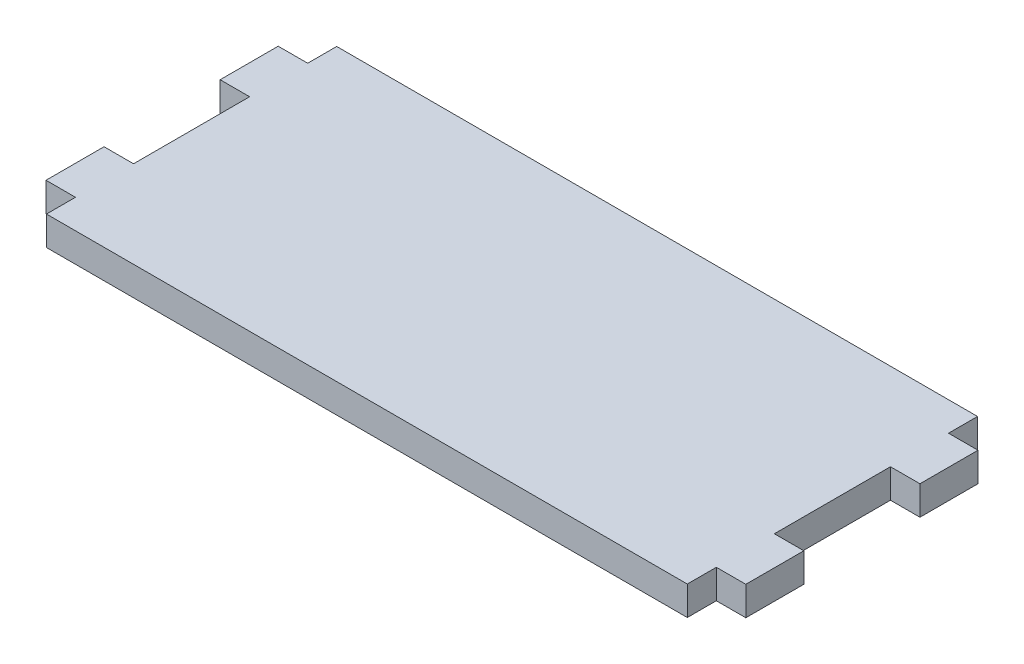
ISO-10303-21;
HEADER;
FILE_DESCRIPTION(('STEP AP214'),'2;1');
FILE_NAME('part.step','',(''),(''),'','','');
FILE_SCHEMA(('AUTOMOTIVE_DESIGN { 1 0 10303 214 1 1 1 1 }'));
ENDSEC;
DATA;
#1=APPLICATION_CONTEXT('core data for automotive mechanical design processes');
#2=APPLICATION_PROTOCOL_DEFINITION('international standard','automotive_design',2000,#1);
#3=PRODUCT_CONTEXT('',#1,'mechanical');
#4=PRODUCT('Part','Part','',(#3));
#5=PRODUCT_RELATED_PRODUCT_CATEGORY('part','',(#4));
#6=PRODUCT_DEFINITION_FORMATION('','',#4);
#7=PRODUCT_DEFINITION_CONTEXT('part definition',#1,'design');
#8=PRODUCT_DEFINITION('design','',#6,#7);
#9=PRODUCT_DEFINITION_SHAPE('','',#8);
#10=(LENGTH_UNIT() NAMED_UNIT(*) SI_UNIT(.MILLI.,.METRE.));
#11=(NAMED_UNIT(*) PLANE_ANGLE_UNIT() SI_UNIT($,.RADIAN.));
#12=(NAMED_UNIT(*) SI_UNIT($,.STERADIAN.) SOLID_ANGLE_UNIT());
#13=UNCERTAINTY_MEASURE_WITH_UNIT(LENGTH_MEASURE(1.E-05),#10,'distance_accuracy_value','');
#14=(GEOMETRIC_REPRESENTATION_CONTEXT(3) GLOBAL_UNCERTAINTY_ASSIGNED_CONTEXT((#13)) GLOBAL_UNIT_ASSIGNED_CONTEXT((#10,
#11,#12)) REPRESENTATION_CONTEXT('',''));
#15=CARTESIAN_POINT('',(0.,0.,0.));
#16=DIRECTION('',(0.,0.,1.));
#17=DIRECTION('',(1.,0.,0.));
#18=AXIS2_PLACEMENT_3D('',#15,#16,#17);
#19=CARTESIAN_POINT('',(35.052,3.175,15.875));
#20=DIRECTION('',(-1.,0.,0.));
#21=DIRECTION('',(0.,0.,1.));
#22=AXIS2_PLACEMENT_3D('',#19,#20,#21);
#23=PLANE('',#22);
#24=DIRECTION('',(0.,1.,0.));
#25=VECTOR('',#24,1.);
#26=CARTESIAN_POINT('',(35.052,0.,6.35));
#27=LINE('',#26,#25);
#28=CARTESIAN_POINT('',(35.052,0.,6.35));
#29=VERTEX_POINT('',#28);
#30=CARTESIAN_POINT('',(35.052,3.175,6.35));
#31=VERTEX_POINT('',#30);
#32=EDGE_CURVE('E204',#29,#31,#27,.T.);
#33=ORIENTED_EDGE('',*,*,#32,.F.);
#34=DIRECTION('',(0.,0.,-1.));
#35=VECTOR('',#34,1.);
#36=CARTESIAN_POINT('',(35.052,0.,15.875));
#37=LINE('',#36,#35);
#38=CARTESIAN_POINT('',(35.052,0.,-6.35));
#39=VERTEX_POINT('',#38);
#40=EDGE_CURVE('E231',#29,#39,#37,.T.);
#41=ORIENTED_EDGE('',*,*,#40,.T.);
#42=DIRECTION('',(0.,1.,0.));
#43=VECTOR('',#42,1.);
#44=CARTESIAN_POINT('',(35.052,0.,-6.35));
#45=LINE('',#44,#43);
#46=CARTESIAN_POINT('',(35.052,3.175,-6.35));
#47=VERTEX_POINT('',#46);
#48=EDGE_CURVE('E347',#39,#47,#45,.T.);
#49=ORIENTED_EDGE('',*,*,#48,.T.);
#50=DIRECTION('',(0.,0.,-1.));
#51=VECTOR('',#50,1.);
#52=CARTESIAN_POINT('',(35.052,3.175,15.875));
#53=LINE('',#52,#51);
#54=EDGE_CURVE('E36',#31,#47,#53,.T.);
#55=ORIENTED_EDGE('',*,*,#54,.F.);
#56=EDGE_LOOP('',(#33,#41,#49,#55));
#57=FACE_BOUND('',#56,.T.);
#58=ADVANCED_FACE('F33',(#57),#23,.F.);
#59=DIRECTION('',(0.,1.,0.));
#60=VECTOR('',#59,1.);
#61=CARTESIAN_POINT('',(35.052,0.,12.7));
#62=LINE('',#61,#60);
#63=CARTESIAN_POINT('',(35.052,0.,12.7));
#64=VERTEX_POINT('',#63);
#65=CARTESIAN_POINT('',(35.052,3.175,12.7));
#66=VERTEX_POINT('',#65);
#67=EDGE_CURVE('E57',#64,#66,#62,.T.);
#68=ORIENTED_EDGE('',*,*,#67,.T.);
#69=CARTESIAN_POINT('',(35.052,3.175,15.875));
#70=VERTEX_POINT('',#69);
#71=EDGE_CURVE('E330',#70,#66,#53,.T.);
#72=ORIENTED_EDGE('',*,*,#71,.F.);
#73=DIRECTION('',(0.,-1.,0.));
#74=VECTOR('',#73,1.);
#75=CARTESIAN_POINT('',(35.052,3.175,15.875));
#76=LINE('',#75,#74);
#77=CARTESIAN_POINT('',(35.052,0.,15.875));
#78=VERTEX_POINT('',#77);
#79=EDGE_CURVE('E274',#70,#78,#76,.T.);
#80=ORIENTED_EDGE('',*,*,#79,.T.);
#81=EDGE_CURVE('E233',#78,#64,#37,.T.);
#82=ORIENTED_EDGE('',*,*,#81,.T.);
#83=EDGE_LOOP('',(#68,#72,#80,#82));
#84=FACE_BOUND('',#83,.T.);
#85=ADVANCED_FACE('F423',(#84),#23,.F.);
#86=DIRECTION('',(0.,1.,0.));
#87=VECTOR('',#86,1.);
#88=CARTESIAN_POINT('',(35.052,0.,-12.7));
#89=LINE('',#88,#87);
#90=CARTESIAN_POINT('',(35.052,0.,-12.7));
#91=VERTEX_POINT('',#90);
#92=CARTESIAN_POINT('',(35.052,3.175,-12.7));
#93=VERTEX_POINT('',#92);
#94=EDGE_CURVE('E222',#91,#93,#89,.T.);
#95=ORIENTED_EDGE('',*,*,#94,.F.);
#96=CARTESIAN_POINT('',(35.052,0.,-15.875));
#97=VERTEX_POINT('',#96);
#98=EDGE_CURVE('E234',#91,#97,#37,.T.);
#99=ORIENTED_EDGE('',*,*,#98,.T.);
#100=DIRECTION('',(0.,-1.,0.));
#101=VECTOR('',#100,1.);
#102=CARTESIAN_POINT('',(35.052,3.175,-15.875));
#103=LINE('',#102,#101);
#104=CARTESIAN_POINT('',(35.052,3.175,-15.875));
#105=VERTEX_POINT('',#104);
#106=EDGE_CURVE('E11',#105,#97,#103,.T.);
#107=ORIENTED_EDGE('',*,*,#106,.F.);
#108=EDGE_CURVE('E273',#93,#105,#53,.T.);
#109=ORIENTED_EDGE('',*,*,#108,.F.);
#110=EDGE_LOOP('',(#95,#99,#107,#109));
#111=FACE_BOUND('',#110,.T.);
#112=ADVANCED_FACE('F341',(#111),#23,.F.);
#113=CARTESIAN_POINT('',(-35.052,3.175,15.875));
#114=DIRECTION('',(1.,0.,0.));
#115=DIRECTION('',(0.,0.,-1.));
#116=AXIS2_PLACEMENT_3D('',#113,#114,#115);
#117=PLANE('',#116);
#118=DIRECTION('',(0.,0.,1.));
#119=VECTOR('',#118,1.);
#120=CARTESIAN_POINT('',(-35.052,3.175,15.875));
#121=LINE('',#120,#119);
#122=CARTESIAN_POINT('',(-35.052,3.175,12.7));
#123=VERTEX_POINT('',#122);
#124=CARTESIAN_POINT('',(-35.052,3.175,15.875));
#125=VERTEX_POINT('',#124);
#126=EDGE_CURVE('E248',#123,#125,#121,.T.);
#127=ORIENTED_EDGE('',*,*,#126,.F.);
#128=DIRECTION('',(0.,1.,0.));
#129=VECTOR('',#128,1.);
#130=CARTESIAN_POINT('',(-35.052,0.,12.7));
#131=LINE('',#130,#129);
#132=CARTESIAN_POINT('',(-35.052,0.,12.7));
#133=VERTEX_POINT('',#132);
#134=EDGE_CURVE('E385',#133,#123,#131,.T.);
#135=ORIENTED_EDGE('',*,*,#134,.F.);
#136=DIRECTION('',(0.,0.,1.));
#137=VECTOR('',#136,1.);
#138=CARTESIAN_POINT('',(-35.052,0.,15.875));
#139=LINE('',#138,#137);
#140=CARTESIAN_POINT('',(-35.052,0.,15.875));
#141=VERTEX_POINT('',#140);
#142=EDGE_CURVE('E252',#133,#141,#139,.T.);
#143=ORIENTED_EDGE('',*,*,#142,.T.);
#144=DIRECTION('',(0.,-1.,0.));
#145=VECTOR('',#144,1.);
#146=CARTESIAN_POINT('',(-35.052,3.175,15.875));
#147=LINE('',#146,#145);
#148=EDGE_CURVE('E277',#125,#141,#147,.T.);
#149=ORIENTED_EDGE('',*,*,#148,.F.);
#150=EDGE_LOOP('',(#127,#135,#143,#149));
#151=FACE_BOUND('',#150,.T.);
#152=ADVANCED_FACE('F416',(#151),#117,.F.);
#153=CARTESIAN_POINT('',(-35.052,0.,-6.35));
#154=VERTEX_POINT('',#153);
#155=CARTESIAN_POINT('',(-35.052,0.,6.35));
#156=VERTEX_POINT('',#155);
#157=EDGE_CURVE('E264',#154,#156,#139,.T.);
#158=ORIENTED_EDGE('',*,*,#157,.T.);
#159=DIRECTION('',(0.,1.,0.));
#160=VECTOR('',#159,1.);
#161=CARTESIAN_POINT('',(-35.052,0.,6.35));
#162=LINE('',#161,#160);
#163=CARTESIAN_POINT('',(-35.052,3.175,6.35));
#164=VERTEX_POINT('',#163);
#165=EDGE_CURVE('E377',#156,#164,#162,.T.);
#166=ORIENTED_EDGE('',*,*,#165,.T.);
#167=CARTESIAN_POINT('',(-35.052,3.175,-6.35));
#168=VERTEX_POINT('',#167);
#169=EDGE_CURVE('E250',#168,#164,#121,.T.);
#170=ORIENTED_EDGE('',*,*,#169,.F.);
#171=DIRECTION('',(0.,1.,0.));
#172=VECTOR('',#171,1.);
#173=CARTESIAN_POINT('',(-35.052,0.,-6.35));
#174=LINE('',#173,#172);
#175=EDGE_CURVE('E314',#154,#168,#174,.T.);
#176=ORIENTED_EDGE('',*,*,#175,.F.);
#177=EDGE_LOOP('',(#158,#166,#170,#176));
#178=FACE_BOUND('',#177,.T.);
#179=ADVANCED_FACE('F397',(#178),#117,.F.);
#180=CARTESIAN_POINT('',(-35.052,3.175,-15.875));
#181=DIRECTION('',(0.,0.,1.));
#182=DIRECTION('',(1.,0.,0.));
#183=AXIS2_PLACEMENT_3D('',#180,#181,#182);
#184=PLANE('',#183);
#185=DIRECTION('',(-1.,0.,0.));
#186=VECTOR('',#185,1.);
#187=CARTESIAN_POINT('',(-35.052,0.,-15.875));
#188=LINE('',#187,#186);
#189=CARTESIAN_POINT('',(-35.052,0.,-15.875));
#190=VERTEX_POINT('',#189);
#191=EDGE_CURVE('E240',#97,#190,#188,.T.);
#192=ORIENTED_EDGE('',*,*,#191,.T.);
#193=DIRECTION('',(0.,-1.,0.));
#194=VECTOR('',#193,1.);
#195=CARTESIAN_POINT('',(-35.052,3.175,-15.875));
#196=LINE('',#195,#194);
#197=CARTESIAN_POINT('',(-35.052,3.175,-15.875));
#198=VERTEX_POINT('',#197);
#199=EDGE_CURVE('E42',#198,#190,#196,.T.);
#200=ORIENTED_EDGE('',*,*,#199,.F.);
#201=DIRECTION('',(-1.,0.,0.));
#202=VECTOR('',#201,1.);
#203=CARTESIAN_POINT('',(-35.052,3.175,-15.875));
#204=LINE('',#203,#202);
#205=EDGE_CURVE('E251',#105,#198,#204,.T.);
#206=ORIENTED_EDGE('',*,*,#205,.F.);
#207=ORIENTED_EDGE('',*,*,#106,.T.);
#208=EDGE_LOOP('',(#192,#200,#206,#207));
#209=FACE_BOUND('',#208,.T.);
#210=ADVANCED_FACE('F340',(#209),#184,.F.);
#211=CARTESIAN_POINT('',(-35.052,0.,-12.7));
#212=VERTEX_POINT('',#211);
#213=EDGE_CURVE('E266',#190,#212,#139,.T.);
#214=ORIENTED_EDGE('',*,*,#213,.T.);
#215=DIRECTION('',(0.,1.,0.));
#216=VECTOR('',#215,1.);
#217=CARTESIAN_POINT('',(-35.052,0.,-12.7));
#218=LINE('',#217,#216);
#219=CARTESIAN_POINT('',(-35.052,3.175,-12.7));
#220=VERTEX_POINT('',#219);
#221=EDGE_CURVE('E309',#212,#220,#218,.T.);
#222=ORIENTED_EDGE('',*,*,#221,.T.);
#223=EDGE_CURVE('E261',#198,#220,#121,.T.);
#224=ORIENTED_EDGE('',*,*,#223,.F.);
#225=ORIENTED_EDGE('',*,*,#199,.T.);
#226=EDGE_LOOP('',(#214,#222,#224,#225));
#227=FACE_BOUND('',#226,.T.);
#228=ADVANCED_FACE('F286',(#227),#117,.F.);
#229=CARTESIAN_POINT('',(-35.052,3.175,15.875));
#230=DIRECTION('',(0.,0.,-1.));
#231=DIRECTION('',(-1.,0.,0.));
#232=AXIS2_PLACEMENT_3D('',#229,#230,#231);
#233=PLANE('',#232);
#234=DIRECTION('',(1.,0.,0.));
#235=VECTOR('',#234,1.);
#236=CARTESIAN_POINT('',(-35.052,0.,15.875));
#237=LINE('',#236,#235);
#238=EDGE_CURVE('E269',#141,#78,#237,.T.);
#239=ORIENTED_EDGE('',*,*,#238,.T.);
#240=ORIENTED_EDGE('',*,*,#79,.F.);
#241=DIRECTION('',(1.,0.,0.));
#242=VECTOR('',#241,1.);
#243=CARTESIAN_POINT('',(-35.052,3.175,15.875));
#244=LINE('',#243,#242);
#245=EDGE_CURVE('E238',#125,#70,#244,.T.);
#246=ORIENTED_EDGE('',*,*,#245,.F.);
#247=ORIENTED_EDGE('',*,*,#148,.T.);
#248=EDGE_LOOP('',(#239,#240,#246,#247));
#249=FACE_BOUND('',#248,.T.);
#250=ADVANCED_FACE('F421',(#249),#233,.F.);
#251=CARTESIAN_POINT('',(35.052,3.175,-15.875));
#252=DIRECTION('',(0.,-1.,0.));
#253=DIRECTION('',(0.,0.,-1.));
#254=AXIS2_PLACEMENT_3D('',#251,#252,#253);
#255=PLANE('',#254);
#256=ORIENTED_EDGE('',*,*,#71,.T.);
#257=DIRECTION('',(-1.,0.,0.));
#258=VECTOR('',#257,1.);
#259=CARTESIAN_POINT('',(38.2778,3.175,12.7));
#260=LINE('',#259,#258);
#261=CARTESIAN_POINT('',(38.2778,3.175,12.7));
#262=VERTEX_POINT('',#261);
#263=EDGE_CURVE('E201',#262,#66,#260,.T.);
#264=ORIENTED_EDGE('',*,*,#263,.F.);
#265=DIRECTION('',(0.,0.,1.));
#266=VECTOR('',#265,1.);
#267=CARTESIAN_POINT('',(38.2778,3.175,6.35));
#268=LINE('',#267,#266);
#269=CARTESIAN_POINT('',(38.2778,3.175,6.35));
#270=VERTEX_POINT('',#269);
#271=EDGE_CURVE('E189',#270,#262,#268,.T.);
#272=ORIENTED_EDGE('',*,*,#271,.F.);
#273=DIRECTION('',(1.,0.,0.));
#274=VECTOR('',#273,1.);
#275=CARTESIAN_POINT('',(35.052,3.175,6.35));
#276=LINE('',#275,#274);
#277=EDGE_CURVE('E196',#31,#270,#276,.T.);
#278=ORIENTED_EDGE('',*,*,#277,.F.);
#279=ORIENTED_EDGE('',*,*,#54,.T.);
#280=DIRECTION('',(-1.,0.,0.));
#281=VECTOR('',#280,1.);
#282=CARTESIAN_POINT('',(38.2778,3.175,-6.35));
#283=LINE('',#282,#281);
#284=CARTESIAN_POINT('',(38.2778,3.175,-6.35));
#285=VERTEX_POINT('',#284);
#286=EDGE_CURVE('E207',#285,#47,#283,.T.);
#287=ORIENTED_EDGE('',*,*,#286,.F.);
#288=DIRECTION('',(0.,0.,1.));
#289=VECTOR('',#288,1.);
#290=CARTESIAN_POINT('',(38.2778,3.175,-12.7));
#291=LINE('',#290,#289);
#292=CARTESIAN_POINT('',(38.2778,3.175,-12.7));
#293=VERTEX_POINT('',#292);
#294=EDGE_CURVE('E214',#293,#285,#291,.T.);
#295=ORIENTED_EDGE('',*,*,#294,.F.);
#296=DIRECTION('',(1.,0.,0.));
#297=VECTOR('',#296,1.);
#298=CARTESIAN_POINT('',(35.052,3.175,-12.7));
#299=LINE('',#298,#297);
#300=EDGE_CURVE('E216',#93,#293,#299,.T.);
#301=ORIENTED_EDGE('',*,*,#300,.F.);
#302=ORIENTED_EDGE('',*,*,#108,.T.);
#303=ORIENTED_EDGE('',*,*,#205,.T.);
#304=ORIENTED_EDGE('',*,*,#223,.T.);
#305=DIRECTION('',(-1.,0.,0.));
#306=VECTOR('',#305,1.);
#307=CARTESIAN_POINT('',(-35.052,3.175,-12.7));
#308=LINE('',#307,#306);
#309=CARTESIAN_POINT('',(-38.2778,3.175,-12.7));
#310=VERTEX_POINT('',#309);
#311=EDGE_CURVE('E388',#220,#310,#308,.T.);
#312=ORIENTED_EDGE('',*,*,#311,.T.);
#313=DIRECTION('',(0.,0.,1.));
#314=VECTOR('',#313,1.);
#315=CARTESIAN_POINT('',(-38.2778,3.175,-12.7));
#316=LINE('',#315,#314);
#317=CARTESIAN_POINT('',(-38.2778,3.175,-6.35));
#318=VERTEX_POINT('',#317);
#319=EDGE_CURVE('E305',#310,#318,#316,.T.);
#320=ORIENTED_EDGE('',*,*,#319,.T.);
#321=DIRECTION('',(1.,0.,0.));
#322=VECTOR('',#321,1.);
#323=CARTESIAN_POINT('',(-38.2778,3.175,-6.35));
#324=LINE('',#323,#322);
#325=EDGE_CURVE('E300',#318,#168,#324,.T.);
#326=ORIENTED_EDGE('',*,*,#325,.T.);
#327=ORIENTED_EDGE('',*,*,#169,.T.);
#328=DIRECTION('',(-1.,0.,0.));
#329=VECTOR('',#328,1.);
#330=CARTESIAN_POINT('',(-35.052,3.175,6.35));
#331=LINE('',#330,#329);
#332=CARTESIAN_POINT('',(-38.2778,3.175,6.35));
#333=VERTEX_POINT('',#332);
#334=EDGE_CURVE('E226',#164,#333,#331,.T.);
#335=ORIENTED_EDGE('',*,*,#334,.T.);
#336=DIRECTION('',(0.,0.,1.));
#337=VECTOR('',#336,1.);
#338=CARTESIAN_POINT('',(-38.2778,3.175,6.35));
#339=LINE('',#338,#337);
#340=CARTESIAN_POINT('',(-38.2778,3.175,12.7));
#341=VERTEX_POINT('',#340);
#342=EDGE_CURVE('E380',#333,#341,#339,.T.);
#343=ORIENTED_EDGE('',*,*,#342,.T.);
#344=DIRECTION('',(1.,0.,0.));
#345=VECTOR('',#344,1.);
#346=CARTESIAN_POINT('',(-38.2778,3.175,12.7));
#347=LINE('',#346,#345);
#348=EDGE_CURVE('E371',#341,#123,#347,.T.);
#349=ORIENTED_EDGE('',*,*,#348,.T.);
#350=ORIENTED_EDGE('',*,*,#126,.T.);
#351=ORIENTED_EDGE('',*,*,#245,.T.);
#352=EDGE_LOOP('',(#256,#264,#272,#278,#279,#287,#295,#301,#302,#303,#304,#312,#320,#326,#327,
#335,#343,#349,#350,#351));
#353=FACE_BOUND('',#352,.T.);
#354=ADVANCED_FACE('F335',(#353),#255,.F.);
#355=CARTESIAN_POINT('',(35.052,0.,-15.875));
#356=DIRECTION('',(0.,-1.,0.));
#357=DIRECTION('',(0.,0.,-1.));
#358=AXIS2_PLACEMENT_3D('',#355,#356,#357);
#359=PLANE('',#358);
#360=ORIENTED_EDGE('',*,*,#81,.F.);
#361=ORIENTED_EDGE('',*,*,#238,.F.);
#362=ORIENTED_EDGE('',*,*,#142,.F.);
#363=DIRECTION('',(1.,0.,0.));
#364=VECTOR('',#363,1.);
#365=CARTESIAN_POINT('',(-38.2778,0.,12.7));
#366=LINE('',#365,#364);
#367=CARTESIAN_POINT('',(-38.2778,0.,12.7));
#368=VERTEX_POINT('',#367);
#369=EDGE_CURVE('E374',#368,#133,#366,.T.);
#370=ORIENTED_EDGE('',*,*,#369,.F.);
#371=DIRECTION('',(0.,0.,1.));
#372=VECTOR('',#371,1.);
#373=CARTESIAN_POINT('',(-38.2778,0.,6.35));
#374=LINE('',#373,#372);
#375=CARTESIAN_POINT('',(-38.2778,0.,6.35));
#376=VERTEX_POINT('',#375);
#377=EDGE_CURVE('E370',#376,#368,#374,.T.);
#378=ORIENTED_EDGE('',*,*,#377,.F.);
#379=DIRECTION('',(-1.,0.,0.));
#380=VECTOR('',#379,1.);
#381=CARTESIAN_POINT('',(-35.052,0.,6.35));
#382=LINE('',#381,#380);
#383=EDGE_CURVE('E367',#156,#376,#382,.T.);
#384=ORIENTED_EDGE('',*,*,#383,.F.);
#385=ORIENTED_EDGE('',*,*,#157,.F.);
#386=DIRECTION('',(1.,0.,0.));
#387=VECTOR('',#386,1.);
#388=CARTESIAN_POINT('',(-38.2778,0.,-6.35));
#389=LINE('',#388,#387);
#390=CARTESIAN_POINT('',(-38.2778,0.,-6.35));
#391=VERTEX_POINT('',#390);
#392=EDGE_CURVE('E302',#391,#154,#389,.T.);
#393=ORIENTED_EDGE('',*,*,#392,.F.);
#394=DIRECTION('',(0.,0.,1.));
#395=VECTOR('',#394,1.);
#396=CARTESIAN_POINT('',(-38.2778,0.,-12.7));
#397=LINE('',#396,#395);
#398=CARTESIAN_POINT('',(-38.2778,0.,-12.7));
#399=VERTEX_POINT('',#398);
#400=EDGE_CURVE('E298',#399,#391,#397,.T.);
#401=ORIENTED_EDGE('',*,*,#400,.F.);
#402=DIRECTION('',(-1.,0.,0.));
#403=VECTOR('',#402,1.);
#404=CARTESIAN_POINT('',(-35.052,0.,-12.7));
#405=LINE('',#404,#403);
#406=EDGE_CURVE('E295',#212,#399,#405,.T.);
#407=ORIENTED_EDGE('',*,*,#406,.F.);
#408=ORIENTED_EDGE('',*,*,#213,.F.);
#409=ORIENTED_EDGE('',*,*,#191,.F.);
#410=ORIENTED_EDGE('',*,*,#98,.F.);
#411=DIRECTION('',(1.,0.,0.));
#412=VECTOR('',#411,1.);
#413=CARTESIAN_POINT('',(35.052,0.,-12.7));
#414=LINE('',#413,#412);
#415=CARTESIAN_POINT('',(38.2778,0.,-12.7));
#416=VERTEX_POINT('',#415);
#417=EDGE_CURVE('E212',#91,#416,#414,.T.);
#418=ORIENTED_EDGE('',*,*,#417,.T.);
#419=DIRECTION('',(0.,0.,1.));
#420=VECTOR('',#419,1.);
#421=CARTESIAN_POINT('',(38.2778,0.,-12.7));
#422=LINE('',#421,#420);
#423=CARTESIAN_POINT('',(38.2778,0.,-6.35));
#424=VERTEX_POINT('',#423);
#425=EDGE_CURVE('E210',#416,#424,#422,.T.);
#426=ORIENTED_EDGE('',*,*,#425,.T.);
#427=DIRECTION('',(-1.,0.,0.));
#428=VECTOR('',#427,1.);
#429=CARTESIAN_POINT('',(38.2778,0.,-6.35));
#430=LINE('',#429,#428);
#431=EDGE_CURVE('E213',#424,#39,#430,.T.);
#432=ORIENTED_EDGE('',*,*,#431,.T.);
#433=ORIENTED_EDGE('',*,*,#40,.F.);
#434=DIRECTION('',(1.,0.,0.));
#435=VECTOR('',#434,1.);
#436=CARTESIAN_POINT('',(35.052,0.,6.35));
#437=LINE('',#436,#435);
#438=CARTESIAN_POINT('',(38.2778,0.,6.35));
#439=VERTEX_POINT('',#438);
#440=EDGE_CURVE('E180',#29,#439,#437,.T.);
#441=ORIENTED_EDGE('',*,*,#440,.T.);
#442=DIRECTION('',(0.,0.,1.));
#443=VECTOR('',#442,1.);
#444=CARTESIAN_POINT('',(38.2778,0.,6.35));
#445=LINE('',#444,#443);
#446=CARTESIAN_POINT('',(38.2778,0.,12.7));
#447=VERTEX_POINT('',#446);
#448=EDGE_CURVE('E173',#439,#447,#445,.T.);
#449=ORIENTED_EDGE('',*,*,#448,.T.);
#450=DIRECTION('',(-1.,0.,0.));
#451=VECTOR('',#450,1.);
#452=CARTESIAN_POINT('',(38.2778,0.,12.7));
#453=LINE('',#452,#451);
#454=EDGE_CURVE('E178',#447,#64,#453,.T.);
#455=ORIENTED_EDGE('',*,*,#454,.T.);
#456=EDGE_LOOP('',(#360,#361,#362,#370,#378,#384,#385,#393,#401,#407,#408,#409,#410,#418,#426,
#432,#433,#441,#449,#455));
#457=FACE_BOUND('',#456,.T.);
#458=ADVANCED_FACE('F176',(#457),#359,.T.);
#459=CARTESIAN_POINT('',(-38.2778,0.,-6.35));
#460=DIRECTION('',(0.,0.,1.));
#461=DIRECTION('',(1.,0.,0.));
#462=AXIS2_PLACEMENT_3D('',#459,#460,#461);
#463=PLANE('',#462);
#464=ORIENTED_EDGE('',*,*,#325,.F.);
#465=DIRECTION('',(0.,1.,0.));
#466=VECTOR('',#465,1.);
#467=CARTESIAN_POINT('',(-38.2778,0.,-6.35));
#468=LINE('',#467,#466);
#469=EDGE_CURVE('E317',#391,#318,#468,.T.);
#470=ORIENTED_EDGE('',*,*,#469,.F.);
#471=ORIENTED_EDGE('',*,*,#392,.T.);
#472=ORIENTED_EDGE('',*,*,#175,.T.);
#473=EDGE_LOOP('',(#464,#470,#471,#472));
#474=FACE_BOUND('',#473,.T.);
#475=ADVANCED_FACE('F455',(#474),#463,.T.);
#476=CARTESIAN_POINT('',(-38.2778,0.,-12.7));
#477=DIRECTION('',(-1.,0.,0.));
#478=DIRECTION('',(0.,0.,1.));
#479=AXIS2_PLACEMENT_3D('',#476,#477,#478);
#480=PLANE('',#479);
#481=ORIENTED_EDGE('',*,*,#319,.F.);
#482=DIRECTION('',(0.,1.,0.));
#483=VECTOR('',#482,1.);
#484=CARTESIAN_POINT('',(-38.2778,0.,-12.7));
#485=LINE('',#484,#483);
#486=EDGE_CURVE('E323',#399,#310,#485,.T.);
#487=ORIENTED_EDGE('',*,*,#486,.F.);
#488=ORIENTED_EDGE('',*,*,#400,.T.);
#489=ORIENTED_EDGE('',*,*,#469,.T.);
#490=EDGE_LOOP('',(#481,#487,#488,#489));
#491=FACE_BOUND('',#490,.T.);
#492=ADVANCED_FACE('F458',(#491),#480,.T.);
#493=CARTESIAN_POINT('',(-35.052,0.,-12.7));
#494=DIRECTION('',(0.,0.,-1.));
#495=DIRECTION('',(-1.,0.,0.));
#496=AXIS2_PLACEMENT_3D('',#493,#494,#495);
#497=PLANE('',#496);
#498=ORIENTED_EDGE('',*,*,#311,.F.);
#499=ORIENTED_EDGE('',*,*,#221,.F.);
#500=ORIENTED_EDGE('',*,*,#406,.T.);
#501=ORIENTED_EDGE('',*,*,#486,.T.);
#502=EDGE_LOOP('',(#498,#499,#500,#501));
#503=FACE_BOUND('',#502,.T.);
#504=ADVANCED_FACE('F450',(#503),#497,.T.);
#505=CARTESIAN_POINT('',(-38.2778,0.,12.7));
#506=DIRECTION('',(0.,0.,1.));
#507=DIRECTION('',(1.,0.,0.));
#508=AXIS2_PLACEMENT_3D('',#505,#506,#507);
#509=PLANE('',#508);
#510=ORIENTED_EDGE('',*,*,#348,.F.);
#511=DIRECTION('',(0.,1.,0.));
#512=VECTOR('',#511,1.);
#513=CARTESIAN_POINT('',(-38.2778,0.,12.7));
#514=LINE('',#513,#512);
#515=EDGE_CURVE('E389',#368,#341,#514,.T.);
#516=ORIENTED_EDGE('',*,*,#515,.F.);
#517=ORIENTED_EDGE('',*,*,#369,.T.);
#518=ORIENTED_EDGE('',*,*,#134,.T.);
#519=EDGE_LOOP('',(#510,#516,#517,#518));
#520=FACE_BOUND('',#519,.T.);
#521=ADVANCED_FACE('F412',(#520),#509,.T.);
#522=CARTESIAN_POINT('',(-38.2778,0.,6.35));
#523=DIRECTION('',(-1.,0.,0.));
#524=DIRECTION('',(0.,0.,1.));
#525=AXIS2_PLACEMENT_3D('',#522,#523,#524);
#526=PLANE('',#525);
#527=ORIENTED_EDGE('',*,*,#342,.F.);
#528=DIRECTION('',(0.,1.,0.));
#529=VECTOR('',#528,1.);
#530=CARTESIAN_POINT('',(-38.2778,0.,6.35));
#531=LINE('',#530,#529);
#532=EDGE_CURVE('E391',#376,#333,#531,.T.);
#533=ORIENTED_EDGE('',*,*,#532,.F.);
#534=ORIENTED_EDGE('',*,*,#377,.T.);
#535=ORIENTED_EDGE('',*,*,#515,.T.);
#536=EDGE_LOOP('',(#527,#533,#534,#535));
#537=FACE_BOUND('',#536,.T.);
#538=ADVANCED_FACE('F409',(#537),#526,.T.);
#539=CARTESIAN_POINT('',(-35.052,0.,6.35));
#540=DIRECTION('',(0.,0.,-1.));
#541=DIRECTION('',(-1.,0.,0.));
#542=AXIS2_PLACEMENT_3D('',#539,#540,#541);
#543=PLANE('',#542);
#544=ORIENTED_EDGE('',*,*,#334,.F.);
#545=ORIENTED_EDGE('',*,*,#165,.F.);
#546=ORIENTED_EDGE('',*,*,#383,.T.);
#547=ORIENTED_EDGE('',*,*,#532,.T.);
#548=EDGE_LOOP('',(#544,#545,#546,#547));
#549=FACE_BOUND('',#548,.T.);
#550=ADVANCED_FACE('F405',(#549),#543,.T.);
#551=CARTESIAN_POINT('',(35.052,0.,-12.7));
#552=DIRECTION('',(0.,0.,1.));
#553=DIRECTION('',(1.,0.,0.));
#554=AXIS2_PLACEMENT_3D('',#551,#552,#553);
#555=PLANE('',#554);
#556=ORIENTED_EDGE('',*,*,#300,.T.);
#557=DIRECTION('',(0.,1.,0.));
#558=VECTOR('',#557,1.);
#559=CARTESIAN_POINT('',(38.2778,0.,-12.7));
#560=LINE('',#559,#558);
#561=EDGE_CURVE('E219',#416,#293,#560,.T.);
#562=ORIENTED_EDGE('',*,*,#561,.F.);
#563=ORIENTED_EDGE('',*,*,#417,.F.);
#564=ORIENTED_EDGE('',*,*,#94,.T.);
#565=EDGE_LOOP('',(#556,#562,#563,#564));
#566=FACE_BOUND('',#565,.T.);
#567=ADVANCED_FACE('F349',(#566),#555,.F.);
#568=CARTESIAN_POINT('',(38.2778,0.,-12.7));
#569=DIRECTION('',(-1.,0.,0.));
#570=DIRECTION('',(0.,0.,1.));
#571=AXIS2_PLACEMENT_3D('',#568,#569,#570);
#572=PLANE('',#571);
#573=ORIENTED_EDGE('',*,*,#294,.T.);
#574=DIRECTION('',(0.,1.,0.));
#575=VECTOR('',#574,1.);
#576=CARTESIAN_POINT('',(38.2778,0.,-6.35));
#577=LINE('',#576,#575);
#578=EDGE_CURVE('E351',#424,#285,#577,.T.);
#579=ORIENTED_EDGE('',*,*,#578,.F.);
#580=ORIENTED_EDGE('',*,*,#425,.F.);
#581=ORIENTED_EDGE('',*,*,#561,.T.);
#582=EDGE_LOOP('',(#573,#579,#580,#581));
#583=FACE_BOUND('',#582,.T.);
#584=ADVANCED_FACE('F352',(#583),#572,.F.);
#585=CARTESIAN_POINT('',(38.2778,0.,-6.35));
#586=DIRECTION('',(0.,0.,-1.));
#587=DIRECTION('',(-1.,0.,0.));
#588=AXIS2_PLACEMENT_3D('',#585,#586,#587);
#589=PLANE('',#588);
#590=ORIENTED_EDGE('',*,*,#286,.T.);
#591=ORIENTED_EDGE('',*,*,#48,.F.);
#592=ORIENTED_EDGE('',*,*,#431,.F.);
#593=ORIENTED_EDGE('',*,*,#578,.T.);
#594=EDGE_LOOP('',(#590,#591,#592,#593));
#595=FACE_BOUND('',#594,.T.);
#596=ADVANCED_FACE('F357',(#595),#589,.F.);
#597=CARTESIAN_POINT('',(35.052,0.,6.35));
#598=DIRECTION('',(0.,0.,1.));
#599=DIRECTION('',(1.,0.,0.));
#600=AXIS2_PLACEMENT_3D('',#597,#598,#599);
#601=PLANE('',#600);
#602=ORIENTED_EDGE('',*,*,#277,.T.);
#603=DIRECTION('',(0.,1.,0.));
#604=VECTOR('',#603,1.);
#605=CARTESIAN_POINT('',(38.2778,0.,6.35));
#606=LINE('',#605,#604);
#607=EDGE_CURVE('E193',#439,#270,#606,.T.);
#608=ORIENTED_EDGE('',*,*,#607,.F.);
#609=ORIENTED_EDGE('',*,*,#440,.F.);
#610=ORIENTED_EDGE('',*,*,#32,.T.);
#611=EDGE_LOOP('',(#602,#608,#609,#610));
#612=FACE_BOUND('',#611,.T.);
#613=ADVANCED_FACE('F432',(#612),#601,.F.);
#614=CARTESIAN_POINT('',(38.2778,0.,6.35));
#615=DIRECTION('',(-1.,0.,0.));
#616=DIRECTION('',(0.,0.,1.));
#617=AXIS2_PLACEMENT_3D('',#614,#615,#616);
#618=PLANE('',#617);
#619=ORIENTED_EDGE('',*,*,#271,.T.);
#620=DIRECTION('',(0.,1.,0.));
#621=VECTOR('',#620,1.);
#622=CARTESIAN_POINT('',(38.2778,0.,12.7));
#623=LINE('',#622,#621);
#624=EDGE_CURVE('E186',#447,#262,#623,.T.);
#625=ORIENTED_EDGE('',*,*,#624,.F.);
#626=ORIENTED_EDGE('',*,*,#448,.F.);
#627=ORIENTED_EDGE('',*,*,#607,.T.);
#628=EDGE_LOOP('',(#619,#625,#626,#627));
#629=FACE_BOUND('',#628,.T.);
#630=ADVANCED_FACE('F187',(#629),#618,.F.);
#631=CARTESIAN_POINT('',(38.2778,0.,12.7));
#632=DIRECTION('',(0.,0.,-1.));
#633=DIRECTION('',(-1.,0.,0.));
#634=AXIS2_PLACEMENT_3D('',#631,#632,#633);
#635=PLANE('',#634);
#636=ORIENTED_EDGE('',*,*,#263,.T.);
#637=ORIENTED_EDGE('',*,*,#67,.F.);
#638=ORIENTED_EDGE('',*,*,#454,.F.);
#639=ORIENTED_EDGE('',*,*,#624,.T.);
#640=EDGE_LOOP('',(#636,#637,#638,#639));
#641=FACE_BOUND('',#640,.T.);
#642=ADVANCED_FACE('F195',(#641),#635,.F.);
#643=CLOSED_SHELL('',(#58,#85,#112,#152,#179,#210,#228,#250,#354,#458,#475,#492,#504,#521,#538,
#550,#567,#584,#596,#613,#630,#642));
#644=MANIFOLD_SOLID_BREP('B2',#643);
#645=ADVANCED_BREP_SHAPE_REPRESENTATION('',(#18,#644),#14);
#646=SHAPE_DEFINITION_REPRESENTATION(#9,#645);
ENDSEC;
END-ISO-10303-21;
